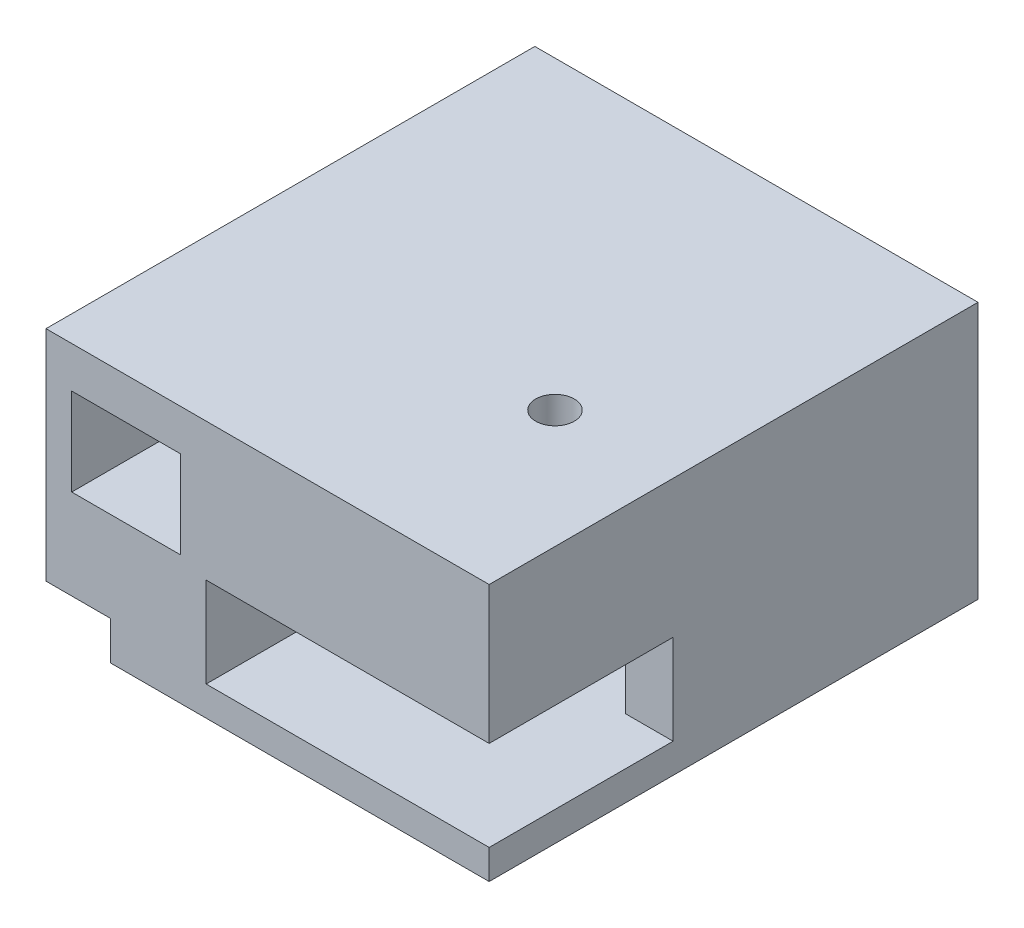
ISO-10303-21;
HEADER;
FILE_DESCRIPTION(('STEP AP214'),'2;1');
FILE_NAME('part.step','',(''),(''),'','','');
FILE_SCHEMA(('AUTOMOTIVE_DESIGN { 1 0 10303 214 1 1 1 1 }'));
ENDSEC;
DATA;
#1=APPLICATION_CONTEXT('core data for automotive mechanical design processes');
#2=APPLICATION_PROTOCOL_DEFINITION('international standard','automotive_design',2000,#1);
#3=PRODUCT_CONTEXT('',#1,'mechanical');
#4=PRODUCT('Part','Part','',(#3));
#5=PRODUCT_RELATED_PRODUCT_CATEGORY('part','',(#4));
#6=PRODUCT_DEFINITION_FORMATION('','',#4);
#7=PRODUCT_DEFINITION_CONTEXT('part definition',#1,'design');
#8=PRODUCT_DEFINITION('design','',#6,#7);
#9=PRODUCT_DEFINITION_SHAPE('','',#8);
#10=(LENGTH_UNIT() NAMED_UNIT(*) SI_UNIT(.MILLI.,.METRE.));
#11=(NAMED_UNIT(*) PLANE_ANGLE_UNIT() SI_UNIT($,.RADIAN.));
#12=(NAMED_UNIT(*) SI_UNIT($,.STERADIAN.) SOLID_ANGLE_UNIT());
#13=UNCERTAINTY_MEASURE_WITH_UNIT(LENGTH_MEASURE(1.E-05),#10,'distance_accuracy_value','');
#14=(GEOMETRIC_REPRESENTATION_CONTEXT(3) GLOBAL_UNCERTAINTY_ASSIGNED_CONTEXT((#13)) GLOBAL_UNIT_ASSIGNED_CONTEXT((#10,
#11,#12)) REPRESENTATION_CONTEXT('',''));
#15=CARTESIAN_POINT('',(0.,0.,0.));
#16=DIRECTION('',(0.,0.,1.));
#17=DIRECTION('',(1.,0.,0.));
#18=AXIS2_PLACEMENT_3D('',#15,#16,#17);
#19=CARTESIAN_POINT('',(12.125,-500000.,0.));
#20=DIRECTION('',(1.,0.,0.));
#21=DIRECTION('',(0.,0.,1.));
#22=AXIS2_PLACEMENT_3D('',#19,#20,#21);
#23=PLANE('',#22);
#24=DIRECTION('',(0.,-1.,0.));
#25=VECTOR('',#24,1.);
#26=CARTESIAN_POINT('',(12.125,28.9501505877455,18.4638204994987));
#27=LINE('',#26,#25);
#28=CARTESIAN_POINT('',(12.125,-2.70000000000437,18.4638204994987));
#29=VERTEX_POINT('',#28);
#30=CARTESIAN_POINT('',(12.125,4.3,18.4638204994987));
#31=VERTEX_POINT('',#30);
#32=EDGE_CURVE('E11',#29,#31,#27,.F.);
#33=ORIENTED_EDGE('',*,*,#32,.T.);
#34=DIRECTION('',(0.,0.,1.));
#35=VECTOR('',#34,1.);
#36=CARTESIAN_POINT('',(12.125,4.3,0.));
#37=LINE('',#36,#35);
#38=CARTESIAN_POINT('',(12.125,4.3,0.));
#39=VERTEX_POINT('',#38);
#40=EDGE_CURVE('E398',#39,#31,#37,.T.);
#41=ORIENTED_EDGE('',*,*,#40,.F.);
#42=DIRECTION('',(0.,1.,0.));
#43=VECTOR('',#42,1.);
#44=CARTESIAN_POINT('',(12.125,-500000.,0.));
#45=LINE('',#44,#43);
#46=CARTESIAN_POINT('',(12.125,-2.70000000011805,0.));
#47=VERTEX_POINT('',#46);
#48=EDGE_CURVE('E263',#47,#39,#45,.T.);
#49=ORIENTED_EDGE('',*,*,#48,.F.);
#50=DIRECTION('',(0.,0.,-1.));
#51=VECTOR('',#50,1.);
#52=CARTESIAN_POINT('',(12.125,-2.70000000000437,0.));
#53=LINE('',#52,#51);
#54=EDGE_CURVE('E257',#29,#47,#53,.T.);
#55=ORIENTED_EDGE('',*,*,#54,.F.);
#56=EDGE_LOOP('',(#33,#41,#49,#55));
#57=FACE_BOUND('',#56,.T.);
#58=ADVANCED_FACE('F37',(#57),#23,.F.);
#59=CARTESIAN_POINT('',(0.,5.,38.));
#60=DIRECTION('',(0.,1.,0.));
#61=DIRECTION('',(-1.,0.,0.));
#62=AXIS2_PLACEMENT_3D('',#59,#60,#61);
#63=PLANE('',#62);
#64=DIRECTION('',(-1.,0.,0.));
#65=VECTOR('',#64,1.);
#66=CARTESIAN_POINT('',(3.82743866176395,5.,7.81246621596943));
#67=LINE('',#66,#65);
#68=CARTESIAN_POINT('',(-4.375,5.,7.81246621596943));
#69=VERTEX_POINT('',#68);
#70=CARTESIAN_POINT('',(-12.825,5.,7.81246621596943));
#71=VERTEX_POINT('',#70);
#72=EDGE_CURVE('E388',#69,#71,#67,.T.);
#73=ORIENTED_EDGE('',*,*,#72,.T.);
#74=DIRECTION('',(0.,0.,1.));
#75=VECTOR('',#74,1.);
#76=CARTESIAN_POINT('',(-12.825,5.,38.));
#77=LINE('',#76,#75);
#78=CARTESIAN_POINT('',(-12.825,5.,38.));
#79=VERTEX_POINT('',#78);
#80=EDGE_CURVE('E401',#71,#79,#77,.T.);
#81=ORIENTED_EDGE('',*,*,#80,.T.);
#82=DIRECTION('',(-1.,0.,0.));
#83=VECTOR('',#82,1.);
#84=CARTESIAN_POINT('',(0.,5.,38.));
#85=LINE('',#84,#83);
#86=CARTESIAN_POINT('',(-4.375,5.,38.));
#87=VERTEX_POINT('',#86);
#88=EDGE_CURVE('E219',#87,#79,#85,.T.);
#89=ORIENTED_EDGE('',*,*,#88,.F.);
#90=DIRECTION('',(0.,0.,-1.));
#91=VECTOR('',#90,1.);
#92=CARTESIAN_POINT('',(-4.375,5.,38.));
#93=LINE('',#92,#91);
#94=EDGE_CURVE('E324',#87,#69,#93,.T.);
#95=ORIENTED_EDGE('',*,*,#94,.T.);
#96=EDGE_LOOP('',(#73,#81,#89,#95));
#97=FACE_BOUND('',#96,.T.);
#98=ADVANCED_FACE('F409',(#97),#63,.T.);
#99=CARTESIAN_POINT('',(0.,-2.7,38.));
#100=DIRECTION('',(0.,1.,0.));
#101=DIRECTION('',(-1.,0.,0.));
#102=AXIS2_PLACEMENT_3D('',#99,#100,#101);
#103=PLANE('',#102);
#104=CARTESIAN_POINT('',(10.44201924,-2.7,23.7));
#105=DIRECTION('',(0.,-1.,0.));
#106=DIRECTION('',(-1.,0.,0.));
#107=AXIS2_PLACEMENT_3D('',#104,#105,#106);
#108=CIRCLE('',#107,1.5);
#109=CARTESIAN_POINT('',(8.94201924000001,-2.7,23.7));
#110=VERTEX_POINT('',#109);
#111=EDGE_CURVE('E342',#110,#110,#108,.F.);
#112=ORIENTED_EDGE('',*,*,#111,.F.);
#113=EDGE_LOOP('',(#112));
#114=FACE_BOUND('',#113,.T.);
#115=DIRECTION('',(-1.,0.,0.));
#116=VECTOR('',#115,1.);
#117=CARTESIAN_POINT('',(0.,-2.7,38.));
#118=LINE('',#117,#116);
#119=CARTESIAN_POINT('',(19.625,-2.7,38.));
#120=VERTEX_POINT('',#119);
#121=CARTESIAN_POINT('',(-2.375,-2.7,38.));
#122=VERTEX_POINT('',#121);
#123=EDGE_CURVE('E183',#120,#122,#118,.T.);
#124=ORIENTED_EDGE('',*,*,#123,.F.);
#125=DIRECTION('',(0.,0.,1.));
#126=VECTOR('',#125,1.);
#127=CARTESIAN_POINT('',(19.625,-2.7,0.));
#128=LINE('',#127,#126);
#129=CARTESIAN_POINT('',(19.625,-2.7,23.7));
#130=VERTEX_POINT('',#129);
#131=EDGE_CURVE('E193',#130,#120,#128,.T.);
#132=ORIENTED_EDGE('',*,*,#131,.F.);
#133=DIRECTION('',(1.,0.,0.));
#134=VECTOR('',#133,1.);
#135=CARTESIAN_POINT('',(0.,-2.7,23.7));
#136=LINE('',#135,#134);
#137=CARTESIAN_POINT('',(15.94201924,-2.7,23.7));
#138=VERTEX_POINT('',#137);
#139=EDGE_CURVE('E380',#138,#130,#136,.T.);
#140=ORIENTED_EDGE('',*,*,#139,.F.);
#141=CARTESIAN_POINT('',(10.44201924,-2.7,23.7));
#142=DIRECTION('',(0.,-1.,0.));
#143=DIRECTION('',(-1.,0.,0.));
#144=AXIS2_PLACEMENT_3D('',#141,#142,#143);
#145=CIRCLE('',#144,5.5);
#146=EDGE_CURVE('E52',#29,#138,#145,.T.);
#147=ORIENTED_EDGE('',*,*,#146,.F.);
#148=ORIENTED_EDGE('',*,*,#54,.T.);
#149=DIRECTION('',(-1.,0.,0.));
#150=VECTOR('',#149,1.);
#151=CARTESIAN_POINT('',(0.,-2.7,0.));
#152=LINE('',#151,#150);
#153=CARTESIAN_POINT('',(-2.375,-2.7,0.));
#154=VERTEX_POINT('',#153);
#155=EDGE_CURVE('E206',#47,#154,#152,.T.);
#156=ORIENTED_EDGE('',*,*,#155,.T.);
#157=DIRECTION('',(0.,0.,-1.));
#158=VECTOR('',#157,1.);
#159=CARTESIAN_POINT('',(-2.375,-2.7,38.));
#160=LINE('',#159,#158);
#161=EDGE_CURVE('E45',#122,#154,#160,.T.);
#162=ORIENTED_EDGE('',*,*,#161,.F.);
#163=EDGE_LOOP('',(#124,#132,#140,#147,#148,#156,#162));
#164=FACE_BOUND('',#163,.T.);
#165=ADVANCED_FACE('F39',(#114,#164),#103,.T.);
#166=CARTESIAN_POINT('',(0.,4.3,38.));
#167=DIRECTION('',(0.,1.,0.));
#168=DIRECTION('',(0.,0.,-1.));
#169=AXIS2_PLACEMENT_3D('',#166,#167,#168);
#170=PLANE('',#169);
#171=DIRECTION('',(0.,0.,-1.));
#172=VECTOR('',#171,1.);
#173=CARTESIAN_POINT('',(-2.375,4.3,38.));
#174=LINE('',#173,#172);
#175=CARTESIAN_POINT('',(-2.375,4.3,38.));
#176=VERTEX_POINT('',#175);
#177=CARTESIAN_POINT('',(-2.375,4.3,0.));
#178=VERTEX_POINT('',#177);
#179=EDGE_CURVE('E226',#176,#178,#174,.T.);
#180=ORIENTED_EDGE('',*,*,#179,.T.);
#181=DIRECTION('',(-1.,0.,0.));
#182=VECTOR('',#181,1.);
#183=CARTESIAN_POINT('',(0.,4.3,0.));
#184=LINE('',#183,#182);
#185=EDGE_CURVE('E265',#39,#178,#184,.T.);
#186=ORIENTED_EDGE('',*,*,#185,.F.);
#187=ORIENTED_EDGE('',*,*,#40,.T.);
#188=CARTESIAN_POINT('',(10.44201924,4.3,23.7));
#189=DIRECTION('',(0.,-1.,0.));
#190=DIRECTION('',(0.,0.,-1.));
#191=AXIS2_PLACEMENT_3D('',#188,#189,#190);
#192=CIRCLE('',#191,5.5);
#193=CARTESIAN_POINT('',(15.94201924,4.3,23.7));
#194=VERTEX_POINT('',#193);
#195=EDGE_CURVE('E376',#31,#194,#192,.T.);
#196=ORIENTED_EDGE('',*,*,#195,.T.);
#197=DIRECTION('',(1.,0.,0.));
#198=VECTOR('',#197,1.);
#199=CARTESIAN_POINT('',(0.,4.3,23.7));
#200=LINE('',#199,#198);
#201=CARTESIAN_POINT('',(19.625,4.3,23.7));
#202=VERTEX_POINT('',#201);
#203=EDGE_CURVE('E373',#194,#202,#200,.T.);
#204=ORIENTED_EDGE('',*,*,#203,.T.);
#205=DIRECTION('',(0.,0.,1.));
#206=VECTOR('',#205,1.);
#207=CARTESIAN_POINT('',(19.625,4.3,0.));
#208=LINE('',#207,#206);
#209=CARTESIAN_POINT('',(19.625,4.3,38.));
#210=VERTEX_POINT('',#209);
#211=EDGE_CURVE('E368',#202,#210,#208,.T.);
#212=ORIENTED_EDGE('',*,*,#211,.T.);
#213=DIRECTION('',(-1.,0.,0.));
#214=VECTOR('',#213,1.);
#215=CARTESIAN_POINT('',(0.,4.3,38.));
#216=LINE('',#215,#214);
#217=EDGE_CURVE('E271',#210,#176,#216,.T.);
#218=ORIENTED_EDGE('',*,*,#217,.T.);
#219=EDGE_LOOP('',(#180,#186,#187,#196,#204,#212,#218));
#220=FACE_BOUND('',#219,.T.);
#221=CARTESIAN_POINT('',(10.44201924,4.3,23.7));
#222=DIRECTION('',(0.,-1.,0.));
#223=DIRECTION('',(0.,0.,-1.));
#224=AXIS2_PLACEMENT_3D('',#221,#222,#223);
#225=CIRCLE('',#224,1.5);
#226=CARTESIAN_POINT('',(10.44201924,4.3,22.2));
#227=VERTEX_POINT('',#226);
#228=EDGE_CURVE('E341',#227,#227,#225,.F.);
#229=ORIENTED_EDGE('',*,*,#228,.T.);
#230=EDGE_LOOP('',(#229));
#231=FACE_BOUND('',#230,.T.);
#232=ADVANCED_FACE('F369',(#220,#231),#170,.F.);
#233=DIRECTION('',(-1.,0.,0.));
#234=VECTOR('',#233,1.);
#235=CARTESIAN_POINT('',(3.82743866176395,5.,3.18753378403057));
#236=LINE('',#235,#234);
#237=CARTESIAN_POINT('',(-12.825,5.,3.18753378403057));
#238=VERTEX_POINT('',#237);
#239=CARTESIAN_POINT('',(-4.375,5.,3.18753378403057));
#240=VERTEX_POINT('',#239);
#241=EDGE_CURVE('E385',#238,#240,#236,.F.);
#242=ORIENTED_EDGE('',*,*,#241,.T.);
#243=CARTESIAN_POINT('',(-4.375,5.,0.));
#244=VERTEX_POINT('',#243);
#245=EDGE_CURVE('E321',#240,#244,#93,.T.);
#246=ORIENTED_EDGE('',*,*,#245,.T.);
#247=DIRECTION('',(-1.,0.,0.));
#248=VECTOR('',#247,1.);
#249=CARTESIAN_POINT('',(0.,5.,0.));
#250=LINE('',#249,#248);
#251=CARTESIAN_POINT('',(-12.825,5.,0.));
#252=VERTEX_POINT('',#251);
#253=EDGE_CURVE('E239',#244,#252,#250,.T.);
#254=ORIENTED_EDGE('',*,*,#253,.T.);
#255=EDGE_CURVE('E403',#252,#238,#77,.T.);
#256=ORIENTED_EDGE('',*,*,#255,.T.);
#257=EDGE_LOOP('',(#242,#246,#254,#256));
#258=FACE_BOUND('',#257,.T.);
#259=ADVANCED_FACE('F415',(#258),#63,.T.);
#260=CARTESIAN_POINT('',(0.,11.8,38.));
#261=DIRECTION('',(0.,1.,0.));
#262=DIRECTION('',(-1.,0.,0.));
#263=AXIS2_PLACEMENT_3D('',#260,#261,#262);
#264=PLANE('',#263);
#265=DIRECTION('',(0.,0.,1.));
#266=VECTOR('',#265,1.);
#267=CARTESIAN_POINT('',(-12.825,11.7999999999938,38.));
#268=LINE('',#267,#266);
#269=CARTESIAN_POINT('',(-12.825,11.7999999999938,0.));
#270=VERTEX_POINT('',#269);
#271=CARTESIAN_POINT('',(-12.825,11.7999999999938,38.));
#272=VERTEX_POINT('',#271);
#273=EDGE_CURVE('E314',#270,#272,#268,.T.);
#274=ORIENTED_EDGE('',*,*,#273,.F.);
#275=DIRECTION('',(-1.,0.,0.));
#276=VECTOR('',#275,1.);
#277=CARTESIAN_POINT('',(0.,11.8,0.));
#278=LINE('',#277,#276);
#279=CARTESIAN_POINT('',(-4.375,11.7999999999938,0.));
#280=VERTEX_POINT('',#279);
#281=EDGE_CURVE('E297',#280,#270,#278,.T.);
#282=ORIENTED_EDGE('',*,*,#281,.F.);
#283=DIRECTION('',(0.,0.,-1.));
#284=VECTOR('',#283,1.);
#285=CARTESIAN_POINT('',(-4.375,11.7999999999938,38.));
#286=LINE('',#285,#284);
#287=CARTESIAN_POINT('',(-4.375,11.8,38.));
#288=VERTEX_POINT('',#287);
#289=EDGE_CURVE('E316',#288,#280,#286,.T.);
#290=ORIENTED_EDGE('',*,*,#289,.F.);
#291=DIRECTION('',(-1.,0.,0.));
#292=VECTOR('',#291,1.);
#293=CARTESIAN_POINT('',(0.,11.8,38.));
#294=LINE('',#293,#292);
#295=EDGE_CURVE('E300',#288,#272,#294,.T.);
#296=ORIENTED_EDGE('',*,*,#295,.T.);
#297=EDGE_LOOP('',(#274,#282,#290,#296));
#298=FACE_BOUND('',#297,.T.);
#299=ADVANCED_FACE('F312',(#298),#264,.F.);
#300=CARTESIAN_POINT('',(-9.825,0.,38.));
#301=DIRECTION('',(-1.,0.,0.));
#302=DIRECTION('',(0.,0.,-1.));
#303=AXIS2_PLACEMENT_3D('',#300,#301,#302);
#304=PLANE('',#303);
#305=DIRECTION('',(0.,0.,-1.));
#306=VECTOR('',#305,1.);
#307=CARTESIAN_POINT('',(-9.825,-5.,38.));
#308=LINE('',#307,#306);
#309=CARTESIAN_POINT('',(-9.825,-5.,38.));
#310=VERTEX_POINT('',#309);
#311=CARTESIAN_POINT('',(-9.825,-5.,16.));
#312=VERTEX_POINT('',#311);
#313=EDGE_CURVE('E244',#310,#312,#308,.T.);
#314=ORIENTED_EDGE('',*,*,#313,.F.);
#315=DIRECTION('',(0.,-1.,0.));
#316=VECTOR('',#315,1.);
#317=CARTESIAN_POINT('',(-9.825,0.,38.));
#318=LINE('',#317,#316);
#319=CARTESIAN_POINT('',(-9.825,-2.,38.));
#320=VERTEX_POINT('',#319);
#321=EDGE_CURVE('E235',#320,#310,#318,.T.);
#322=ORIENTED_EDGE('',*,*,#321,.F.);
#323=DIRECTION('',(0.,0.,-1.));
#324=VECTOR('',#323,1.);
#325=CARTESIAN_POINT('',(-9.825,-2.,38.));
#326=LINE('',#325,#324);
#327=CARTESIAN_POINT('',(-9.825,-2.,16.));
#328=VERTEX_POINT('',#327);
#329=EDGE_CURVE('E247',#320,#328,#326,.T.);
#330=ORIENTED_EDGE('',*,*,#329,.T.);
#331=DIRECTION('',(0.,-1.,0.));
#332=VECTOR('',#331,1.);
#333=CARTESIAN_POINT('',(-9.825,0.,16.));
#334=LINE('',#333,#332);
#335=EDGE_CURVE('E189',#328,#312,#334,.T.);
#336=ORIENTED_EDGE('',*,*,#335,.T.);
#337=EDGE_LOOP('',(#314,#322,#330,#336));
#338=FACE_BOUND('',#337,.T.);
#339=ADVANCED_FACE('F364',(#338),#304,.T.);
#340=CARTESIAN_POINT('',(0.,-2.,38.));
#341=DIRECTION('',(0.,-1.,0.));
#342=DIRECTION('',(0.,0.,1.));
#343=AXIS2_PLACEMENT_3D('',#340,#341,#342);
#344=PLANE('',#343);
#345=ORIENTED_EDGE('',*,*,#329,.F.);
#346=DIRECTION('',(1.,0.,0.));
#347=VECTOR('',#346,1.);
#348=CARTESIAN_POINT('',(0.,-2.,38.));
#349=LINE('',#348,#347);
#350=CARTESIAN_POINT('',(-14.825,-2.,38.));
#351=VERTEX_POINT('',#350);
#352=EDGE_CURVE('E233',#351,#320,#349,.T.);
#353=ORIENTED_EDGE('',*,*,#352,.F.);
#354=DIRECTION('',(0.,0.,-1.));
#355=VECTOR('',#354,1.);
#356=CARTESIAN_POINT('',(-14.825,-2.,38.));
#357=LINE('',#356,#355);
#358=CARTESIAN_POINT('',(-14.825,-2.,16.));
#359=VERTEX_POINT('',#358);
#360=EDGE_CURVE('E236',#351,#359,#357,.T.);
#361=ORIENTED_EDGE('',*,*,#360,.T.);
#362=DIRECTION('',(1.,0.,0.));
#363=VECTOR('',#362,1.);
#364=CARTESIAN_POINT('',(0.,-2.,16.));
#365=LINE('',#364,#363);
#366=EDGE_CURVE('E351',#359,#328,#365,.T.);
#367=ORIENTED_EDGE('',*,*,#366,.T.);
#368=EDGE_LOOP('',(#345,#353,#361,#367));
#369=FACE_BOUND('',#368,.T.);
#370=ADVANCED_FACE('F360',(#369),#344,.T.);
#371=CARTESIAN_POINT('',(-2.375,0.,38.));
#372=DIRECTION('',(-1.,0.,0.));
#373=DIRECTION('',(0.,-1.,0.));
#374=AXIS2_PLACEMENT_3D('',#371,#372,#373);
#375=PLANE('',#374);
#376=ORIENTED_EDGE('',*,*,#179,.F.);
#377=DIRECTION('',(0.,-1.,0.));
#378=VECTOR('',#377,1.);
#379=CARTESIAN_POINT('',(-2.375,0.,38.));
#380=LINE('',#379,#378);
#381=EDGE_CURVE('E216',#176,#122,#380,.T.);
#382=ORIENTED_EDGE('',*,*,#381,.T.);
#383=ORIENTED_EDGE('',*,*,#161,.T.);
#384=DIRECTION('',(0.,-1.,0.));
#385=VECTOR('',#384,1.);
#386=CARTESIAN_POINT('',(-2.375,0.,0.));
#387=LINE('',#386,#385);
#388=EDGE_CURVE('E221',#178,#154,#387,.T.);
#389=ORIENTED_EDGE('',*,*,#388,.F.);
#390=EDGE_LOOP('',(#376,#382,#383,#389));
#391=FACE_BOUND('',#390,.T.);
#392=ADVANCED_FACE('F255',(#391),#375,.F.);
#393=CARTESIAN_POINT('',(0.,-5.,38.));
#394=DIRECTION('',(0.,1.,0.));
#395=DIRECTION('',(-1.,0.,0.));
#396=AXIS2_PLACEMENT_3D('',#393,#394,#395);
#397=PLANE('',#396);
#398=CARTESIAN_POINT('',(10.44201924,-5.,23.7));
#399=DIRECTION('',(0.,-1.,0.));
#400=DIRECTION('',(-1.,0.,0.));
#401=AXIS2_PLACEMENT_3D('',#398,#399,#400);
#402=CIRCLE('',#401,1.5);
#403=CARTESIAN_POINT('',(8.94201924000001,-5.,23.7));
#404=VERTEX_POINT('',#403);
#405=EDGE_CURVE('E335',#404,#404,#402,.F.);
#406=ORIENTED_EDGE('',*,*,#405,.T.);
#407=EDGE_LOOP('',(#406));
#408=FACE_BOUND('',#407,.T.);
#409=DIRECTION('',(-1.,0.,0.));
#410=VECTOR('',#409,1.);
#411=CARTESIAN_POINT('',(0.,-5.,0.));
#412=LINE('',#411,#410);
#413=CARTESIAN_POINT('',(19.625,-5.,0.));
#414=VERTEX_POINT('',#413);
#415=CARTESIAN_POINT('',(-14.825,-5.,0.));
#416=VERTEX_POINT('',#415);
#417=EDGE_CURVE('E203',#414,#416,#412,.T.);
#418=ORIENTED_EDGE('',*,*,#417,.F.);
#419=DIRECTION('',(0.,0.,1.));
#420=VECTOR('',#419,1.);
#421=CARTESIAN_POINT('',(19.625,-5.,0.));
#422=LINE('',#421,#420);
#423=CARTESIAN_POINT('',(19.625,-5.,38.));
#424=VERTEX_POINT('',#423);
#425=EDGE_CURVE('E347',#414,#424,#422,.T.);
#426=ORIENTED_EDGE('',*,*,#425,.T.);
#427=DIRECTION('',(-1.,0.,0.));
#428=VECTOR('',#427,1.);
#429=CARTESIAN_POINT('',(0.,-5.,38.));
#430=LINE('',#429,#428);
#431=EDGE_CURVE('E185',#424,#310,#430,.T.);
#432=ORIENTED_EDGE('',*,*,#431,.T.);
#433=ORIENTED_EDGE('',*,*,#313,.T.);
#434=DIRECTION('',(-1.,0.,0.));
#435=VECTOR('',#434,1.);
#436=CARTESIAN_POINT('',(0.,-5.,16.));
#437=LINE('',#436,#435);
#438=CARTESIAN_POINT('',(-14.825,-5.,16.));
#439=VERTEX_POINT('',#438);
#440=EDGE_CURVE('E296',#312,#439,#437,.T.);
#441=ORIENTED_EDGE('',*,*,#440,.T.);
#442=DIRECTION('',(0.,0.,-1.));
#443=VECTOR('',#442,1.);
#444=CARTESIAN_POINT('',(-14.825,-5.,16.));
#445=LINE('',#444,#443);
#446=EDGE_CURVE('E292',#439,#416,#445,.T.);
#447=ORIENTED_EDGE('',*,*,#446,.T.);
#448=EDGE_LOOP('',(#418,#426,#432,#433,#441,#447));
#449=FACE_BOUND('',#448,.T.);
#450=ADVANCED_FACE('F295',(#408,#449),#397,.F.);
#451=CARTESIAN_POINT('',(0.,0.,38.));
#452=DIRECTION('',(0.,0.,-1.));
#453=DIRECTION('',(1.,0.,0.));
#454=AXIS2_PLACEMENT_3D('',#451,#452,#453);
#455=PLANE('',#454);
#456=DIRECTION('',(0.,1.,0.));
#457=VECTOR('',#456,1.);
#458=CARTESIAN_POINT('',(19.625,-2.7,38.));
#459=LINE('',#458,#457);
#460=CARTESIAN_POINT('',(19.625,15.,38.));
#461=VERTEX_POINT('',#460);
#462=EDGE_CURVE('E190',#210,#461,#459,.T.);
#463=ORIENTED_EDGE('',*,*,#462,.T.);
#464=DIRECTION('',(-1.,0.,0.));
#465=VECTOR('',#464,1.);
#466=CARTESIAN_POINT('',(0.,15.,38.));
#467=LINE('',#466,#465);
#468=CARTESIAN_POINT('',(-14.825,15.,38.));
#469=VERTEX_POINT('',#468);
#470=EDGE_CURVE('E267',#461,#469,#467,.T.);
#471=ORIENTED_EDGE('',*,*,#470,.T.);
#472=DIRECTION('',(0.,1.,0.));
#473=VECTOR('',#472,1.);
#474=CARTESIAN_POINT('',(-14.825,0.,38.));
#475=LINE('',#474,#473);
#476=EDGE_CURVE('E230',#351,#469,#475,.T.);
#477=ORIENTED_EDGE('',*,*,#476,.F.);
#478=ORIENTED_EDGE('',*,*,#352,.T.);
#479=ORIENTED_EDGE('',*,*,#321,.T.);
#480=ORIENTED_EDGE('',*,*,#431,.F.);
#481=EDGE_CURVE('E177',#424,#120,#459,.T.);
#482=ORIENTED_EDGE('',*,*,#481,.T.);
#483=ORIENTED_EDGE('',*,*,#123,.T.);
#484=ORIENTED_EDGE('',*,*,#381,.F.);
#485=ORIENTED_EDGE('',*,*,#217,.F.);
#486=EDGE_LOOP('',(#463,#471,#477,#478,#479,#480,#482,#483,#484,#485));
#487=FACE_BOUND('',#486,.T.);
#488=ORIENTED_EDGE('',*,*,#88,.T.);
#489=DIRECTION('',(0.,-1.,0.));
#490=VECTOR('',#489,1.);
#491=CARTESIAN_POINT('',(-12.8250000001045,500000.,38.));
#492=LINE('',#491,#490);
#493=EDGE_CURVE('E319',#272,#79,#492,.T.);
#494=ORIENTED_EDGE('',*,*,#493,.F.);
#495=ORIENTED_EDGE('',*,*,#295,.F.);
#496=DIRECTION('',(0.,-1.,0.));
#497=VECTOR('',#496,1.);
#498=CARTESIAN_POINT('',(-4.3750000001045,500000.,38.));
#499=LINE('',#498,#497);
#500=EDGE_CURVE('E332',#288,#87,#499,.T.);
#501=ORIENTED_EDGE('',*,*,#500,.T.);
#502=EDGE_LOOP('',(#488,#494,#495,#501));
#503=FACE_BOUND('',#502,.T.);
#504=ADVANCED_FACE('F180',(#487,#503),#455,.F.);
#505=CARTESIAN_POINT('',(0.,0.,0.));
#506=DIRECTION('',(0.,0.,-1.));
#507=DIRECTION('',(1.,0.,0.));
#508=AXIS2_PLACEMENT_3D('',#505,#506,#507);
#509=PLANE('',#508);
#510=ORIENTED_EDGE('',*,*,#48,.T.);
#511=ORIENTED_EDGE('',*,*,#185,.T.);
#512=ORIENTED_EDGE('',*,*,#388,.T.);
#513=ORIENTED_EDGE('',*,*,#155,.F.);
#514=EDGE_LOOP('',(#510,#511,#512,#513));
#515=FACE_BOUND('',#514,.T.);
#516=DIRECTION('',(0.,-1.,0.));
#517=VECTOR('',#516,1.);
#518=CARTESIAN_POINT('',(-12.8250000001045,500000.,0.));
#519=LINE('',#518,#517);
#520=EDGE_CURVE('E320',#270,#252,#519,.T.);
#521=ORIENTED_EDGE('',*,*,#520,.T.);
#522=ORIENTED_EDGE('',*,*,#253,.F.);
#523=DIRECTION('',(0.,-1.,0.));
#524=VECTOR('',#523,1.);
#525=CARTESIAN_POINT('',(-4.3750000001045,500000.,0.));
#526=LINE('',#525,#524);
#527=EDGE_CURVE('E330',#280,#244,#526,.T.);
#528=ORIENTED_EDGE('',*,*,#527,.F.);
#529=ORIENTED_EDGE('',*,*,#281,.T.);
#530=EDGE_LOOP('',(#521,#522,#528,#529));
#531=FACE_BOUND('',#530,.T.);
#532=DIRECTION('',(-1.,0.,0.));
#533=VECTOR('',#532,1.);
#534=CARTESIAN_POINT('',(0.,15.,0.));
#535=LINE('',#534,#533);
#536=CARTESIAN_POINT('',(19.625,15.,0.));
#537=VERTEX_POINT('',#536);
#538=CARTESIAN_POINT('',(-14.825,15.,0.));
#539=VERTEX_POINT('',#538);
#540=EDGE_CURVE('E274',#537,#539,#535,.T.);
#541=ORIENTED_EDGE('',*,*,#540,.F.);
#542=DIRECTION('',(0.,-1.,0.));
#543=VECTOR('',#542,1.);
#544=CARTESIAN_POINT('',(19.625,-2.7,0.));
#545=LINE('',#544,#543);
#546=EDGE_CURVE('E286',#537,#414,#545,.T.);
#547=ORIENTED_EDGE('',*,*,#546,.T.);
#548=ORIENTED_EDGE('',*,*,#417,.T.);
#549=DIRECTION('',(0.,1.,0.));
#550=VECTOR('',#549,1.);
#551=CARTESIAN_POINT('',(-14.825,0.,0.));
#552=LINE('',#551,#550);
#553=EDGE_CURVE('E220',#416,#539,#552,.T.);
#554=ORIENTED_EDGE('',*,*,#553,.T.);
#555=EDGE_LOOP('',(#541,#547,#548,#554));
#556=FACE_BOUND('',#555,.T.);
#557=ADVANCED_FACE('F261',(#515,#531,#556),#509,.T.);
#558=CARTESIAN_POINT('',(-14.825,0.,38.));
#559=DIRECTION('',(1.,0.,0.));
#560=DIRECTION('',(0.,0.,1.));
#561=AXIS2_PLACEMENT_3D('',#558,#559,#560);
#562=PLANE('',#561);
#563=CARTESIAN_POINT('',(-14.825,6.75000000000001,5.5));
#564=DIRECTION('',(1.,0.,0.));
#565=DIRECTION('',(0.,-1.,0.));
#566=AXIS2_PLACEMENT_3D('',#563,#564,#565);
#567=CIRCLE('',#566,1.5);
#568=CARTESIAN_POINT('',(-14.825,5.25000000000001,5.5));
#569=VERTEX_POINT('',#568);
#570=EDGE_CURVE('E394',#569,#569,#567,.T.);
#571=ORIENTED_EDGE('',*,*,#570,.T.);
#572=EDGE_LOOP('',(#571));
#573=FACE_BOUND('',#572,.T.);
#574=ORIENTED_EDGE('',*,*,#553,.F.);
#575=ORIENTED_EDGE('',*,*,#446,.F.);
#576=DIRECTION('',(0.,1.,0.));
#577=VECTOR('',#576,1.);
#578=CARTESIAN_POINT('',(-14.825,0.,16.));
#579=LINE('',#578,#577);
#580=EDGE_CURVE('E302',#439,#359,#579,.T.);
#581=ORIENTED_EDGE('',*,*,#580,.T.);
#582=ORIENTED_EDGE('',*,*,#360,.F.);
#583=ORIENTED_EDGE('',*,*,#476,.T.);
#584=DIRECTION('',(0.,0.,-1.));
#585=VECTOR('',#584,1.);
#586=CARTESIAN_POINT('',(-14.825,15.,38.));
#587=LINE('',#586,#585);
#588=EDGE_CURVE('E278',#469,#539,#587,.T.);
#589=ORIENTED_EDGE('',*,*,#588,.T.);
#590=EDGE_LOOP('',(#574,#575,#581,#582,#583,#589));
#591=FACE_BOUND('',#590,.T.);
#592=ADVANCED_FACE('F291',(#573,#591),#562,.F.);
#593=CARTESIAN_POINT('',(0.,15.,38.));
#594=DIRECTION('',(0.,1.,0.));
#595=DIRECTION('',(-1.,0.,0.));
#596=AXIS2_PLACEMENT_3D('',#593,#594,#595);
#597=PLANE('',#596);
#598=CARTESIAN_POINT('',(10.44201924,15.,23.7));
#599=DIRECTION('',(0.,-1.,0.));
#600=DIRECTION('',(-1.,0.,0.));
#601=AXIS2_PLACEMENT_3D('',#598,#599,#600);
#602=CIRCLE('',#601,1.5);
#603=CARTESIAN_POINT('',(8.94201924,15.,23.7));
#604=VERTEX_POINT('',#603);
#605=EDGE_CURVE('E338',#604,#604,#602,.T.);
#606=ORIENTED_EDGE('',*,*,#605,.T.);
#607=EDGE_LOOP('',(#606));
#608=FACE_BOUND('',#607,.T.);
#609=ORIENTED_EDGE('',*,*,#540,.T.);
#610=ORIENTED_EDGE('',*,*,#588,.F.);
#611=ORIENTED_EDGE('',*,*,#470,.F.);
#612=DIRECTION('',(0.,0.,-1.));
#613=VECTOR('',#612,1.);
#614=CARTESIAN_POINT('',(19.625,15.,0.));
#615=LINE('',#614,#613);
#616=EDGE_CURVE('E283',#461,#537,#615,.T.);
#617=ORIENTED_EDGE('',*,*,#616,.T.);
#618=EDGE_LOOP('',(#609,#610,#611,#617));
#619=FACE_BOUND('',#618,.T.);
#620=ADVANCED_FACE('F282',(#608,#619),#597,.T.);
#621=CARTESIAN_POINT('',(0.,0.,16.));
#622=DIRECTION('',(0.,0.,-1.));
#623=DIRECTION('',(1.,0.,0.));
#624=AXIS2_PLACEMENT_3D('',#621,#622,#623);
#625=PLANE('',#624);
#626=ORIENTED_EDGE('',*,*,#335,.F.);
#627=ORIENTED_EDGE('',*,*,#366,.F.);
#628=ORIENTED_EDGE('',*,*,#580,.F.);
#629=ORIENTED_EDGE('',*,*,#440,.F.);
#630=EDGE_LOOP('',(#626,#627,#628,#629));
#631=FACE_BOUND('',#630,.T.);
#632=ADVANCED_FACE('F357',(#631),#625,.F.);
#633=CARTESIAN_POINT('',(19.625,0.,0.));
#634=DIRECTION('',(1.,0.,0.));
#635=DIRECTION('',(0.,0.,1.));
#636=AXIS2_PLACEMENT_3D('',#633,#634,#635);
#637=PLANE('',#636);
#638=ORIENTED_EDGE('',*,*,#211,.F.);
#639=DIRECTION('',(0.,-1.,0.));
#640=VECTOR('',#639,1.);
#641=CARTESIAN_POINT('',(19.625,28.9501505877455,23.7));
#642=LINE('',#641,#640);
#643=EDGE_CURVE('E196',#202,#130,#642,.T.);
#644=ORIENTED_EDGE('',*,*,#643,.T.);
#645=ORIENTED_EDGE('',*,*,#131,.T.);
#646=ORIENTED_EDGE('',*,*,#481,.F.);
#647=ORIENTED_EDGE('',*,*,#425,.F.);
#648=ORIENTED_EDGE('',*,*,#546,.F.);
#649=ORIENTED_EDGE('',*,*,#616,.F.);
#650=ORIENTED_EDGE('',*,*,#462,.F.);
#651=EDGE_LOOP('',(#638,#644,#645,#646,#647,#648,#649,#650));
#652=FACE_BOUND('',#651,.T.);
#653=ADVANCED_FACE('F195',(#652),#637,.T.);
#654=CARTESIAN_POINT('',(10.44201924,19.2426406871193,23.7));
#655=DIRECTION('',(0.,-1.,0.));
#656=DIRECTION('',(1.,0.,0.));
#657=AXIS2_PLACEMENT_3D('',#654,#655,#656);
#658=CYLINDRICAL_SURFACE('',#657,1.5);
#659=ORIENTED_EDGE('',*,*,#605,.F.);
#660=EDGE_LOOP('',(#659));
#661=FACE_BOUND('',#660,.T.);
#662=ORIENTED_EDGE('',*,*,#228,.F.);
#663=EDGE_LOOP('',(#662));
#664=FACE_BOUND('',#663,.T.);
#665=ADVANCED_FACE('F446',(#661,#664),#658,.F.);
#666=ORIENTED_EDGE('',*,*,#111,.T.);
#667=EDGE_LOOP('',(#666));
#668=FACE_BOUND('',#667,.T.);
#669=ORIENTED_EDGE('',*,*,#405,.F.);
#670=EDGE_LOOP('',(#669));
#671=FACE_BOUND('',#670,.T.);
#672=ADVANCED_FACE('F443',(#668,#671),#658,.F.);
#673=CARTESIAN_POINT('',(-4.3750000001045,500000.,38.));
#674=DIRECTION('',(1.,0.,0.));
#675=DIRECTION('',(0.,1.,0.));
#676=AXIS2_PLACEMENT_3D('',#673,#674,#675);
#677=PLANE('',#676);
#678=ORIENTED_EDGE('',*,*,#94,.F.);
#679=ORIENTED_EDGE('',*,*,#500,.F.);
#680=ORIENTED_EDGE('',*,*,#289,.T.);
#681=ORIENTED_EDGE('',*,*,#527,.T.);
#682=ORIENTED_EDGE('',*,*,#245,.F.);
#683=CARTESIAN_POINT('',(-4.375,6.75000000000001,5.5));
#684=DIRECTION('',(-1.,0.,0.));
#685=DIRECTION('',(0.,1.,0.));
#686=AXIS2_PLACEMENT_3D('',#683,#684,#685);
#687=CIRCLE('',#686,2.9);
#688=EDGE_CURVE('E383',#69,#240,#687,.F.);
#689=ORIENTED_EDGE('',*,*,#688,.F.);
#690=EDGE_LOOP('',(#678,#679,#680,#681,#682,#689));
#691=FACE_BOUND('',#690,.T.);
#692=ADVANCED_FACE('F418',(#691),#677,.F.);
#693=CARTESIAN_POINT('',(-12.8250000001045,500000.,38.));
#694=DIRECTION('',(-1.,0.,0.));
#695=DIRECTION('',(0.,-1.,0.));
#696=AXIS2_PLACEMENT_3D('',#693,#694,#695);
#697=PLANE('',#696);
#698=ORIENTED_EDGE('',*,*,#255,.F.);
#699=ORIENTED_EDGE('',*,*,#520,.F.);
#700=ORIENTED_EDGE('',*,*,#273,.T.);
#701=ORIENTED_EDGE('',*,*,#493,.T.);
#702=ORIENTED_EDGE('',*,*,#80,.F.);
#703=CARTESIAN_POINT('',(-12.825,6.75000000000001,5.5));
#704=DIRECTION('',(1.,0.,0.));
#705=DIRECTION('',(0.,-1.,0.));
#706=AXIS2_PLACEMENT_3D('',#703,#704,#705);
#707=CIRCLE('',#706,2.9);
#708=EDGE_CURVE('E60',#71,#238,#707,.T.);
#709=ORIENTED_EDGE('',*,*,#708,.T.);
#710=EDGE_LOOP('',(#698,#699,#700,#701,#702,#709));
#711=FACE_BOUND('',#710,.T.);
#712=CARTESIAN_POINT('',(-12.825,6.75000000000001,5.5));
#713=DIRECTION('',(1.,0.,0.));
#714=DIRECTION('',(0.,-1.,0.));
#715=AXIS2_PLACEMENT_3D('',#712,#713,#714);
#716=CIRCLE('',#715,1.5);
#717=CARTESIAN_POINT('',(-12.825,5.25000000000001,5.5));
#718=VERTEX_POINT('',#717);
#719=EDGE_CURVE('E391',#718,#718,#716,.F.);
#720=ORIENTED_EDGE('',*,*,#719,.T.);
#721=EDGE_LOOP('',(#720));
#722=FACE_BOUND('',#721,.T.);
#723=ADVANCED_FACE('F317',(#711,#722),#697,.F.);
#724=CARTESIAN_POINT('',(19.626,6.75000000000002,5.5));
#725=DIRECTION('',(-1.,0.,0.));
#726=DIRECTION('',(0.,-1.,0.));
#727=AXIS2_PLACEMENT_3D('',#724,#725,#726);
#728=CYLINDRICAL_SURFACE('',#727,1.5);
#729=ORIENTED_EDGE('',*,*,#570,.F.);
#730=EDGE_LOOP('',(#729));
#731=FACE_BOUND('',#730,.T.);
#732=ORIENTED_EDGE('',*,*,#719,.F.);
#733=EDGE_LOOP('',(#732));
#734=FACE_BOUND('',#733,.T.);
#735=ADVANCED_FACE('F437',(#731,#734),#728,.F.);
#736=CARTESIAN_POINT('',(3.82743866176395,6.75000000000001,5.5));
#737=DIRECTION('',(-1.,0.,0.));
#738=DIRECTION('',(0.,-1.,0.));
#739=AXIS2_PLACEMENT_3D('',#736,#737,#738);
#740=CYLINDRICAL_SURFACE('',#739,2.9);
#741=ORIENTED_EDGE('',*,*,#72,.F.);
#742=ORIENTED_EDGE('',*,*,#688,.T.);
#743=ORIENTED_EDGE('',*,*,#241,.F.);
#744=ORIENTED_EDGE('',*,*,#708,.F.);
#745=EDGE_LOOP('',(#741,#742,#743,#744));
#746=FACE_BOUND('',#745,.T.);
#747=ADVANCED_FACE('F413',(#746),#740,.F.);
#748=CARTESIAN_POINT('',(10.44201924,28.9501505877455,23.7));
#749=DIRECTION('',(0.,-1.,0.));
#750=DIRECTION('',(1.,0.,0.));
#751=AXIS2_PLACEMENT_3D('',#748,#749,#750);
#752=CYLINDRICAL_SURFACE('',#751,5.5);
#753=ORIENTED_EDGE('',*,*,#32,.F.);
#754=ORIENTED_EDGE('',*,*,#146,.T.);
#755=DIRECTION('',(0.,-1.,0.));
#756=VECTOR('',#755,1.);
#757=CARTESIAN_POINT('',(15.94201924,28.9501505877455,23.7));
#758=LINE('',#757,#756);
#759=EDGE_CURVE('E198',#194,#138,#758,.T.);
#760=ORIENTED_EDGE('',*,*,#759,.F.);
#761=ORIENTED_EDGE('',*,*,#195,.F.);
#762=EDGE_LOOP('',(#753,#754,#760,#761));
#763=FACE_BOUND('',#762,.T.);
#764=ADVANCED_FACE('F559',(#763),#752,.F.);
#765=CARTESIAN_POINT('',(0.,28.9501505877455,23.7));
#766=DIRECTION('',(0.,0.,1.));
#767=DIRECTION('',(-1.,0.,0.));
#768=AXIS2_PLACEMENT_3D('',#765,#766,#767);
#769=PLANE('',#768);
#770=ORIENTED_EDGE('',*,*,#203,.F.);
#771=ORIENTED_EDGE('',*,*,#759,.T.);
#772=ORIENTED_EDGE('',*,*,#139,.T.);
#773=ORIENTED_EDGE('',*,*,#643,.F.);
#774=EDGE_LOOP('',(#770,#771,#772,#773));
#775=FACE_BOUND('',#774,.T.);
#776=ADVANCED_FACE('F567',(#775),#769,.T.);
#777=CLOSED_SHELL('',(#58,#98,#165,#232,#259,#299,#339,#370,#392,#450,#504,#557,#592,#620,#632,
#653,#665,#672,#692,#723,#735,#747,#764,#776));
#778=MANIFOLD_SOLID_BREP('B2',#777);
#779=ADVANCED_BREP_SHAPE_REPRESENTATION('',(#18,#778),#14);
#780=SHAPE_DEFINITION_REPRESENTATION(#9,#779);
ENDSEC;
END-ISO-10303-21;
